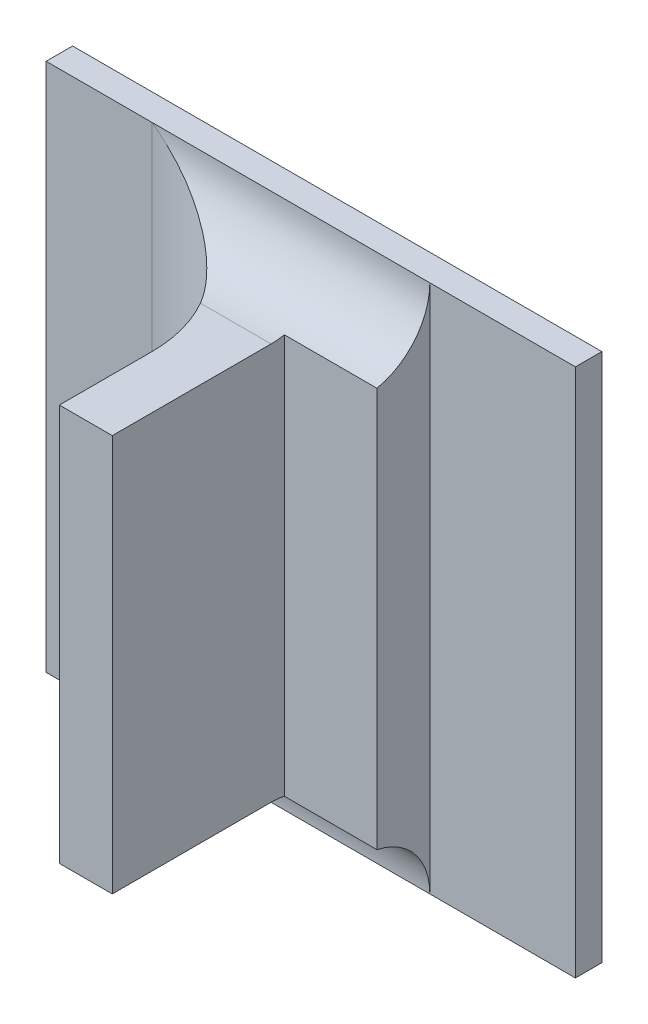
ISO-10303-21;
HEADER;
FILE_DESCRIPTION(('STEP AP214'),'2;1');
FILE_NAME('part.step','',(''),(''),'','','');
FILE_SCHEMA(('AUTOMOTIVE_DESIGN { 1 0 10303 214 1 1 1 1 }'));
ENDSEC;
DATA;
#1=APPLICATION_CONTEXT('core data for automotive mechanical design processes');
#2=APPLICATION_PROTOCOL_DEFINITION('international standard','automotive_design',2000,#1);
#3=PRODUCT_CONTEXT('',#1,'mechanical');
#4=PRODUCT('Part','Part','',(#3));
#5=PRODUCT_RELATED_PRODUCT_CATEGORY('part','',(#4));
#6=PRODUCT_DEFINITION_FORMATION('','',#4);
#7=PRODUCT_DEFINITION_CONTEXT('part definition',#1,'design');
#8=PRODUCT_DEFINITION('design','',#6,#7);
#9=PRODUCT_DEFINITION_SHAPE('','',#8);
#10=(LENGTH_UNIT() NAMED_UNIT(*) SI_UNIT(.MILLI.,.METRE.));
#11=(NAMED_UNIT(*) PLANE_ANGLE_UNIT() SI_UNIT($,.RADIAN.));
#12=(NAMED_UNIT(*) SI_UNIT($,.STERADIAN.) SOLID_ANGLE_UNIT());
#13=UNCERTAINTY_MEASURE_WITH_UNIT(LENGTH_MEASURE(1.E-05),#10,'distance_accuracy_value','');
#14=(GEOMETRIC_REPRESENTATION_CONTEXT(3) GLOBAL_UNCERTAINTY_ASSIGNED_CONTEXT((#13)) GLOBAL_UNIT_ASSIGNED_CONTEXT((#10,
#11,#12)) REPRESENTATION_CONTEXT('',''));
#15=CARTESIAN_POINT('',(0.,0.,0.));
#16=DIRECTION('',(0.,0.,1.));
#17=DIRECTION('',(1.,0.,0.));
#18=AXIS2_PLACEMENT_3D('',#15,#16,#17);
#19=CARTESIAN_POINT('',(-1.06509578137238,-0.311549667580546,0.0888870078740156));
#20=DIRECTION('',(0.,0.,1.));
#21=DIRECTION('',(1.,0.,0.));
#22=AXIS2_PLACEMENT_3D('',#19,#20,#21);
#23=PLANE('',#22);
#24=DIRECTION('',(1.,0.,0.));
#25=VECTOR('',#24,1.);
#26=CARTESIAN_POINT('',(-1.07241135083412,-0.351234706950624,0.0888870078740156));
#27=LINE('',#26,#25);
#28=CARTESIAN_POINT('',(-1.06534774987631,-0.351234706950624,0.0888870078740156));
#29=VERTEX_POINT('',#28);
#30=CARTESIAN_POINT('',(-1.07038711995505,-0.351234706950624,0.0888870078740156));
#31=VERTEX_POINT('',#30);
#32=EDGE_CURVE('E193',#29,#31,#27,.F.);
#33=ORIENTED_EDGE('',*,*,#32,.F.);
#34=DIRECTION('',(0.,1.,0.));
#35=VECTOR('',#34,1.);
#36=CARTESIAN_POINT('',(-1.06534774987631,-0.35326446766354,0.0888870078740156));
#37=LINE('',#36,#35);
#38=CARTESIAN_POINT('',(-1.06534774987631,-0.313439431360073,0.0888870078740156));
#39=VERTEX_POINT('',#38);
#40=EDGE_CURVE('E187',#39,#29,#37,.F.);
#41=ORIENTED_EDGE('',*,*,#40,.F.);
#42=DIRECTION('',(1.,0.,0.));
#43=VECTOR('',#42,1.);
#44=CARTESIAN_POINT('',(-1.07241135083412,-0.313439431360073,0.0888870078740156));
#45=LINE('',#44,#43);
#46=CARTESIAN_POINT('',(-1.07038711995505,-0.313439431360073,0.0888870078740156));
#47=VERTEX_POINT('',#46);
#48=EDGE_CURVE('E180',#39,#47,#45,.F.);
#49=ORIENTED_EDGE('',*,*,#48,.T.);
#50=DIRECTION('',(0.,-1.,0.));
#51=VECTOR('',#50,1.);
#52=CARTESIAN_POINT('',(-1.07038711995505,-0.311549667580546,0.0888870078740156));
#53=LINE('',#52,#51);
#54=EDGE_CURVE('E177',#31,#47,#53,.F.);
#55=ORIENTED_EDGE('',*,*,#54,.F.);
#56=EDGE_LOOP('',(#33,#41,#49,#55));
#57=FACE_BOUND('',#56,.T.);
#58=ADVANCED_FACE('F17',(#57),#23,.T.);
#59=CARTESIAN_POINT('',(-1.07038711995505,-0.311549667580546,0.0796271653543306));
#60=DIRECTION('',(-1.,0.,0.));
#61=DIRECTION('',(0.,-1.,0.));
#62=AXIS2_PLACEMENT_3D('',#59,#60,#61);
#63=PLANE('',#62);
#64=DIRECTION('',(0.,0.,1.));
#65=VECTOR('',#64,1.);
#66=CARTESIAN_POINT('',(-1.07038711995505,-0.313439431360073,0.0730129921259841));
#67=LINE('',#66,#65);
#68=CARTESIAN_POINT('',(-1.07038711995505,-0.313439431360073,0.0800681102362204));
#69=VERTEX_POINT('',#68);
#70=EDGE_CURVE('E184',#47,#69,#67,.F.);
#71=ORIENTED_EDGE('',*,*,#70,.T.);
#72=DIRECTION('',(0.,1.,0.));
#73=VECTOR('',#72,1.);
#74=CARTESIAN_POINT('',(-1.07038711995505,-0.36005360458842,0.0800681102362204));
#75=LINE('',#74,#73);
#76=CARTESIAN_POINT('',(-1.07038711995505,-0.351234706950624,0.0800681102362204));
#77=VERTEX_POINT('',#76);
#78=EDGE_CURVE('E127',#69,#77,#75,.F.);
#79=ORIENTED_EDGE('',*,*,#78,.T.);
#80=DIRECTION('',(0.,0.,1.));
#81=VECTOR('',#80,1.);
#82=CARTESIAN_POINT('',(-1.07038711995505,-0.351234706950624,0.0730129921259841));
#83=LINE('',#82,#81);
#84=EDGE_CURVE('E196',#31,#77,#83,.F.);
#85=ORIENTED_EDGE('',*,*,#84,.F.);
#86=ORIENTED_EDGE('',*,*,#54,.T.);
#87=EDGE_LOOP('',(#71,#79,#85,#86));
#88=FACE_BOUND('',#87,.T.);
#89=ADVANCED_FACE('F242',(#88),#63,.T.);
#90=CARTESIAN_POINT('',(-1.07241135083412,-0.313439431360073,0.0730129921259841));
#91=DIRECTION('',(0.,-1.,0.));
#92=DIRECTION('',(1.,0.,0.));
#93=AXIS2_PLACEMENT_3D('',#90,#91,#92);
#94=PLANE('',#93);
#95=ORIENTED_EDGE('',*,*,#70,.F.);
#96=ORIENTED_EDGE('',*,*,#48,.F.);
#97=DIRECTION('',(0.,0.,1.));
#98=VECTOR('',#97,1.);
#99=CARTESIAN_POINT('',(-1.06534774987631,-0.313439431360073,0.0716901574803148));
#100=LINE('',#99,#98);
#101=CARTESIAN_POINT('',(-1.06534774987631,-0.313439431360073,0.0737688976377952));
#102=VERTEX_POINT('',#101);
#103=EDGE_CURVE('E115',#102,#39,#100,.T.);
#104=ORIENTED_EDGE('',*,*,#103,.F.);
#105=DIRECTION('',(1.,0.,0.));
#106=VECTOR('',#105,1.);
#107=CARTESIAN_POINT('',(-1.08430837979757,-0.313439431360073,0.0737688976377952));
#108=LINE('',#107,#106);
#109=CARTESIAN_POINT('',(-1.07207498888375,-0.313439431360073,0.0737688976377952));
#110=VERTEX_POINT('',#109);
#111=EDGE_CURVE('E109',#102,#110,#108,.F.);
#112=ORIENTED_EDGE('',*,*,#111,.T.);
#113=CARTESIAN_POINT('',(-1.0829855451519,-0.313439431360073,0.0800681102362204));
#114=DIRECTION('',(0.,1.,0.));
#115=DIRECTION('',(-1.,0.,0.));
#116=AXIS2_PLACEMENT_3D('',#113,#114,#115);
#117=CIRCLE('',#116,0.0125984251968504);
#118=EDGE_CURVE('E20',#110,#69,#117,.F.);
#119=ORIENTED_EDGE('',*,*,#118,.T.);
#120=EDGE_LOOP('',(#95,#96,#104,#112,#119));
#121=FACE_BOUND('',#120,.T.);
#122=ADVANCED_FACE('F112',(#121),#94,.F.);
#123=CARTESIAN_POINT('',(-1.07241135083412,-0.351234706950624,0.0730129921259841));
#124=DIRECTION('',(0.,-1.,0.));
#125=DIRECTION('',(1.,0.,0.));
#126=AXIS2_PLACEMENT_3D('',#123,#124,#125);
#127=PLANE('',#126);
#128=CARTESIAN_POINT('',(-1.0829855451519,-0.351234706950624,0.0800681102362204));
#129=DIRECTION('',(0.,1.,0.));
#130=DIRECTION('',(-1.,0.,0.));
#131=AXIS2_PLACEMENT_3D('',#128,#129,#130);
#132=CIRCLE('',#131,0.0125984251968504);
#133=CARTESIAN_POINT('',(-1.07207498888375,-0.351234706950624,0.0737688976377951));
#134=VERTEX_POINT('',#133);
#135=EDGE_CURVE('E121',#77,#134,#132,.T.);
#136=ORIENTED_EDGE('',*,*,#135,.T.);
#137=DIRECTION('',(-1.,0.,0.));
#138=VECTOR('',#137,1.);
#139=CARTESIAN_POINT('',(-1.03007215932513,-0.351234706950625,0.0737688976377952));
#140=LINE('',#139,#138);
#141=CARTESIAN_POINT('',(-1.06534774987631,-0.351234706950624,0.0737688976377952));
#142=VERTEX_POINT('',#141);
#143=EDGE_CURVE('E169',#134,#142,#140,.F.);
#144=ORIENTED_EDGE('',*,*,#143,.T.);
#145=DIRECTION('',(0.,0.,1.));
#146=VECTOR('',#145,1.);
#147=CARTESIAN_POINT('',(-1.06534774987631,-0.351234706950624,0.0716901574803148));
#148=LINE('',#147,#146);
#149=EDGE_CURVE('E190',#29,#142,#148,.F.);
#150=ORIENTED_EDGE('',*,*,#149,.F.);
#151=ORIENTED_EDGE('',*,*,#32,.T.);
#152=ORIENTED_EDGE('',*,*,#84,.T.);
#153=EDGE_LOOP('',(#136,#144,#150,#151,#152));
#154=FACE_BOUND('',#153,.T.);
#155=ADVANCED_FACE('F235',(#154),#127,.T.);
#156=CARTESIAN_POINT('',(-1.06534774987631,-0.35326446766354,0.0716901574803148));
#157=DIRECTION('',(1.,0.,0.));
#158=DIRECTION('',(0.,1.,0.));
#159=AXIS2_PLACEMENT_3D('',#156,#157,#158);
#160=PLANE('',#159);
#161=DIRECTION('',(0.,1.,0.));
#162=VECTOR('',#161,1.);
#163=CARTESIAN_POINT('',(-1.06534774987631,-0.311409670647157,0.0725090551181101));
#164=LINE('',#163,#162);
#165=CARTESIAN_POINT('',(-1.06534774987631,-0.313312161420629,0.0725090551181101));
#166=VERTEX_POINT('',#165);
#167=CARTESIAN_POINT('',(-1.06534774987631,-0.351361976890068,0.0725090551181101));
#168=VERTEX_POINT('',#167);
#169=EDGE_CURVE('E216',#166,#168,#164,.F.);
#170=ORIENTED_EDGE('',*,*,#169,.F.);
#171=CARTESIAN_POINT('',(-1.06534774987631,-0.313312161420629,0.0725090551181101));
#172=CARTESIAN_POINT('',(-1.06534774987631,-0.313439431360073,0.0731325479405746));
#173=CARTESIAN_POINT('',(-1.06534774987631,-0.313439431360073,0.0737688976377952));
#174=B_SPLINE_CURVE_WITH_KNOTS('',2,(#171,#172,#173),.UNSPECIFIED.,.F.,.F.,(3,3),(0.,1.),.UNSPECIFIED.);
#175=EDGE_CURVE('E217',#166,#102,#174,.T.);
#176=ORIENTED_EDGE('',*,*,#175,.T.);
#177=ORIENTED_EDGE('',*,*,#103,.T.);
#178=ORIENTED_EDGE('',*,*,#40,.T.);
#179=ORIENTED_EDGE('',*,*,#149,.T.);
#180=CARTESIAN_POINT('',(-1.06534774987631,-0.351234706950624,0.0737688976377952));
#181=CARTESIAN_POINT('',(-1.06534774987631,-0.351234706950624,0.0731325479405795));
#182=CARTESIAN_POINT('',(-1.06534774987631,-0.351361976890068,0.0725090551181101));
#183=B_SPLINE_CURVE_WITH_KNOTS('',2,(#180,#181,#182),.UNSPECIFIED.,.F.,.F.,(3,3),(0.,1.),.UNSPECIFIED.);
#184=EDGE_CURVE('E221',#142,#168,#183,.T.);
#185=ORIENTED_EDGE('',*,*,#184,.T.);
#186=EDGE_LOOP('',(#170,#176,#177,#178,#179,#185));
#187=FACE_BOUND('',#186,.T.);
#188=ADVANCED_FACE('F224',(#187),#160,.T.);
#189=CARTESIAN_POINT('',(-1.05608790735663,-0.311409670647157,0.0725090551181101));
#190=DIRECTION('',(0.,0.,1.));
#191=DIRECTION('',(1.,0.,0.));
#192=AXIS2_PLACEMENT_3D('',#189,#190,#191);
#193=PLANE('',#192);
#194=DIRECTION('',(0.,1.,0.));
#195=VECTOR('',#194,1.);
#196=CARTESIAN_POINT('',(-1.05652885223852,-0.304620533722278,0.0725090551181101));
#197=LINE('',#196,#195);
#198=CARTESIAN_POINT('',(-1.05652885223852,-0.313312161420629,0.0725090551181101));
#199=VERTEX_POINT('',#198);
#200=CARTESIAN_POINT('',(-1.05652885223852,-0.351361976890069,0.0725090551181102));
#201=VERTEX_POINT('',#200);
#202=EDGE_CURVE('E128',#199,#201,#197,.F.);
#203=ORIENTED_EDGE('',*,*,#202,.F.);
#204=DIRECTION('',(1.,0.,0.));
#205=VECTOR('',#204,1.);
#206=CARTESIAN_POINT('',(-1.08430837979757,-0.313312161420629,0.0725090551181101));
#207=LINE('',#206,#205);
#208=EDGE_CURVE('E139',#199,#166,#207,.F.);
#209=ORIENTED_EDGE('',*,*,#208,.T.);
#210=ORIENTED_EDGE('',*,*,#169,.T.);
#211=DIRECTION('',(-1.,0.,0.));
#212=VECTOR('',#211,1.);
#213=CARTESIAN_POINT('',(-1.03007215932513,-0.351361976890069,0.0725090551181103));
#214=LINE('',#213,#212);
#215=EDGE_CURVE('E174',#168,#201,#214,.F.);
#216=ORIENTED_EDGE('',*,*,#215,.T.);
#217=EDGE_LOOP('',(#203,#209,#210,#216));
#218=FACE_BOUND('',#217,.T.);
#219=ADVANCED_FACE('F234',(#218),#193,.T.);
#220=CARTESIAN_POINT('',(-1.05652885223852,-0.304620533722278,0.067217716535433));
#221=DIRECTION('',(1.,0.,0.));
#222=DIRECTION('',(0.,1.,0.));
#223=AXIS2_PLACEMENT_3D('',#220,#221,#222);
#224=PLANE('',#223);
#225=DIRECTION('',(0.,1.,0.));
#226=VECTOR('',#225,1.);
#227=CARTESIAN_POINT('',(-1.05652885223852,-0.304620533722278,0.06746968503937));
#228=LINE('',#227,#226);
#229=CARTESIAN_POINT('',(-1.05652885223852,-0.35753391954905,0.06746968503937));
#230=VERTEX_POINT('',#229);
#231=CARTESIAN_POINT('',(-1.05652885223852,-0.307140218761648,0.06746968503937));
#232=VERTEX_POINT('',#231);
#233=EDGE_CURVE('E170',#230,#232,#228,.T.);
#234=ORIENTED_EDGE('',*,*,#233,.T.);
#235=CARTESIAN_POINT('',(-1.05652885223852,-0.307140218761648,0.0737688976377952));
#236=DIRECTION('',(1.,0.,0.));
#237=DIRECTION('',(0.,1.,0.));
#238=AXIS2_PLACEMENT_3D('',#235,#236,#237);
#239=CIRCLE('',#238,0.0062992125984252);
#240=EDGE_CURVE('E136',#232,#199,#239,.F.);
#241=ORIENTED_EDGE('',*,*,#240,.T.);
#242=ORIENTED_EDGE('',*,*,#202,.T.);
#243=CARTESIAN_POINT('',(-1.05652885223852,-0.35753391954905,0.0737688976377952));
#244=DIRECTION('',(-1.,0.,0.));
#245=DIRECTION('',(0.,-1.,0.));
#246=AXIS2_PLACEMENT_3D('',#243,#244,#245);
#247=CIRCLE('',#246,0.0062992125984252);
#248=EDGE_CURVE('E171',#201,#230,#247,.T.);
#249=ORIENTED_EDGE('',*,*,#248,.T.);
#250=EDGE_LOOP('',(#234,#241,#242,#249));
#251=FACE_BOUND('',#250,.T.);
#252=ADVANCED_FACE('F318',(#251),#224,.T.);
#253=CARTESIAN_POINT('',(-1.0829855451519,-0.36005360458842,0.0800681102362204));
#254=DIRECTION('',(0.,1.,0.));
#255=DIRECTION('',(-1.,0.,0.));
#256=AXIS2_PLACEMENT_3D('',#253,#254,#255);
#257=CYLINDRICAL_SURFACE('',#256,0.0125984251968504);
#258=ORIENTED_EDGE('',*,*,#78,.F.);
#259=ORIENTED_EDGE('',*,*,#118,.F.);
#260=CARTESIAN_POINT('',(-1.07207498888375,-0.313439431360073,0.073768897637795));
#261=CARTESIAN_POINT('',(-1.07234747338823,-0.313438873707853,0.0732955457546592));
#262=CARTESIAN_POINT('',(-1.07264958551383,-0.313386346377414,0.0728445682080298));
#263=CARTESIAN_POINT('',(-1.07329505328783,-0.313201363699116,0.0720003898002664));
#264=CARTESIAN_POINT('',(-1.07363778576309,-0.313070015578846,0.0716064807283955));
#265=CARTESIAN_POINT('',(-1.07442302288786,-0.312719656172453,0.0708064921171964));
#266=CARTESIAN_POINT('',(-1.07487209401617,-0.312488708936628,0.0704123993317734));
#267=CARTESIAN_POINT('',(-1.07580202027777,-0.311970610304802,0.0697017381084182));
#268=CARTESIAN_POINT('',(-1.07628305354846,-0.311683122697778,0.0693856602556568));
#269=CARTESIAN_POINT('',(-1.07746379099296,-0.310946965938325,0.0687164538298326));
#270=CARTESIAN_POINT('',(-1.07817306810433,-0.310480210038906,0.0684002761150404));
#271=CARTESIAN_POINT('',(-1.07961009581918,-0.309508649017801,0.0679065689436589));
#272=CARTESIAN_POINT('',(-1.08033781457896,-0.309003906866,0.0677288153407497));
#273=CARTESIAN_POINT('',(-1.08151377714844,-0.308179722442743,0.0675478835698786));
#274=CARTESIAN_POINT('',(-1.08195963193271,-0.307865289365079,0.0675035718032503));
#275=CARTESIAN_POINT('',(-1.08259905297728,-0.307413510055304,0.0674741343290926));
#276=CARTESIAN_POINT('',(-1.08279230362694,-0.307276860634179,0.0674696949622004));
#277=CARTESIAN_POINT('',(-1.0829855451519,-0.307140218761648,0.06746968503937));
#278=B_SPLINE_CURVE_WITH_KNOTS('',3,(#260,#261,#262,#263,#264,#265,#266,#267,#268,#269,#270,
#271,#272,#273,#274,#275,#276,#277),.UNSPECIFIED.,.F.,.F.,(4,2,2,2,2,2,2,2,4),(0.,
0.00162828046163526,0.00323420635682056,0.00514617952943915,0.00706988591555801,
0.00977367423346218,0.012473075225337,0.0141132082090728,0.014823218803943),.UNSPECIFIED.);
#279=CARTESIAN_POINT('',(-1.0829855451519,-0.307140218761648,0.06746968503937));
#280=VERTEX_POINT('',#279);
#281=EDGE_CURVE('E120',#110,#280,#278,.T.);
#282=ORIENTED_EDGE('',*,*,#281,.T.);
#283=DIRECTION('',(0.,1.,0.));
#284=VECTOR('',#283,1.);
#285=CARTESIAN_POINT('',(-1.0829855451519,-0.304620533722278,0.06746968503937));
#286=LINE('',#285,#284);
#287=CARTESIAN_POINT('',(-1.0829855451519,-0.35753391954905,0.06746968503937));
#288=VERTEX_POINT('',#287);
#289=EDGE_CURVE('E173',#280,#288,#286,.F.);
#290=ORIENTED_EDGE('',*,*,#289,.T.);
#291=CARTESIAN_POINT('',(-1.07207498888375,-0.351234706950625,0.0737688976377951));
#292=CARTESIAN_POINT('',(-1.07234747338823,-0.351235264602845,0.0732955457546592));
#293=CARTESIAN_POINT('',(-1.07264958551383,-0.351287791933284,0.0728445682080298));
#294=CARTESIAN_POINT('',(-1.07329505328783,-0.351472774611582,0.0720003898002664));
#295=CARTESIAN_POINT('',(-1.07363778576309,-0.351604122731852,0.0716064807283955));
#296=CARTESIAN_POINT('',(-1.07442302288786,-0.351954482138245,0.0708064921171964));
#297=CARTESIAN_POINT('',(-1.07487209401617,-0.35218542937407,0.0704123993317734));
#298=CARTESIAN_POINT('',(-1.07580202027777,-0.352703528005896,0.0697017381084182));
#299=CARTESIAN_POINT('',(-1.07628305354846,-0.35299101561292,0.0693856602556568));
#300=CARTESIAN_POINT('',(-1.07746379099296,-0.353727172372372,0.0687164538298326));
#301=CARTESIAN_POINT('',(-1.07817306810433,-0.354193928271792,0.0684002761150406));
#302=CARTESIAN_POINT('',(-1.07961009581918,-0.355165489292897,0.067906568943659));
#303=CARTESIAN_POINT('',(-1.08033781457896,-0.355670231444698,0.0677288153407497));
#304=CARTESIAN_POINT('',(-1.08151377714844,-0.356494415867954,0.0675478835698786));
#305=CARTESIAN_POINT('',(-1.08195963193271,-0.356808848945619,0.0675035718032502));
#306=CARTESIAN_POINT('',(-1.08259905297728,-0.357260628255394,0.0674741343290926));
#307=CARTESIAN_POINT('',(-1.08279230362694,-0.357397277676519,0.0674696949622004));
#308=CARTESIAN_POINT('',(-1.0829855451519,-0.35753391954905,0.06746968503937));
#309=B_SPLINE_CURVE_WITH_KNOTS('',3,(#291,#292,#293,#294,#295,#296,#297,#298,#299,#300,#301,
#302,#303,#304,#305,#306,#307,#308),.UNSPECIFIED.,.F.,.F.,(4,2,2,2,2,2,2,2,4),(0.,
0.00162828046163526,0.00323420635682057,0.00514617952943914,0.00706988591555801,
0.00977367423346186,0.0124730752253368,0.0141132082090729,0.014823218803943),.UNSPECIFIED.);
#310=EDGE_CURVE('E163',#288,#134,#309,.F.);
#311=ORIENTED_EDGE('',*,*,#310,.T.);
#312=ORIENTED_EDGE('',*,*,#135,.F.);
#313=EDGE_LOOP('',(#258,#259,#282,#290,#311,#312));
#314=FACE_BOUND('',#313,.T.);
#315=ADVANCED_FACE('F124',(#314),#257,.F.);
#316=CARTESIAN_POINT('',(-1.08430837979757,-0.307140218761648,0.0737688976377952));
#317=DIRECTION('',(1.,0.,0.));
#318=DIRECTION('',(0.,1.,0.));
#319=AXIS2_PLACEMENT_3D('',#316,#317,#318);
#320=CYLINDRICAL_SURFACE('',#319,0.0062992125984252);
#321=ORIENTED_EDGE('',*,*,#208,.F.);
#322=ORIENTED_EDGE('',*,*,#240,.F.);
#323=DIRECTION('',(-1.,0.,0.));
#324=VECTOR('',#323,1.);
#325=CARTESIAN_POINT('',(-1.04015089948261,-0.307140218761648,0.06746968503937));
#326=LINE('',#325,#324);
#327=EDGE_CURVE('E134',#280,#232,#326,.F.);
#328=ORIENTED_EDGE('',*,*,#327,.F.);
#329=ORIENTED_EDGE('',*,*,#281,.F.);
#330=ORIENTED_EDGE('',*,*,#111,.F.);
#331=ORIENTED_EDGE('',*,*,#175,.F.);
#332=EDGE_LOOP('',(#321,#322,#328,#329,#330,#331));
#333=FACE_BOUND('',#332,.T.);
#334=ADVANCED_FACE('F131',(#333),#320,.F.);
#335=CARTESIAN_POINT('',(-1.05722176562434,-0.304620533722278,0.06746968503937));
#336=DIRECTION('',(0.,0.,-1.));
#337=DIRECTION('',(-1.,0.,0.));
#338=AXIS2_PLACEMENT_3D('',#335,#336,#337);
#339=PLANE('',#338);
#340=DIRECTION('',(0.,1.,0.));
#341=VECTOR('',#340,1.);
#342=CARTESIAN_POINT('',(-1.04267058452198,-0.36005360458842,0.06746968503937));
#343=LINE('',#342,#341);
#344=CARTESIAN_POINT('',(-1.04267058452198,-0.307140218761648,0.06746968503937));
#345=VERTEX_POINT('',#344);
#346=CARTESIAN_POINT('',(-1.04267058452198,-0.35753391954905,0.06746968503937));
#347=VERTEX_POINT('',#346);
#348=EDGE_CURVE('E281',#345,#347,#343,.F.);
#349=ORIENTED_EDGE('',*,*,#348,.F.);
#350=DIRECTION('',(-1.,0.,0.));
#351=VECTOR('',#350,1.);
#352=CARTESIAN_POINT('',(-1.04015089948261,-0.307140218761648,0.06746968503937));
#353=LINE('',#352,#351);
#354=EDGE_CURVE('E206',#232,#345,#353,.F.);
#355=ORIENTED_EDGE('',*,*,#354,.F.);
#356=ORIENTED_EDGE('',*,*,#233,.F.);
#357=DIRECTION('',(1.,0.,0.));
#358=VECTOR('',#357,1.);
#359=CARTESIAN_POINT('',(-1.09558397034875,-0.35753391954905,0.06746968503937));
#360=LINE('',#359,#358);
#361=EDGE_CURVE('E283',#347,#230,#360,.F.);
#362=ORIENTED_EDGE('',*,*,#361,.F.);
#363=EDGE_LOOP('',(#349,#355,#356,#362));
#364=FACE_BOUND('',#363,.T.);
#365=ADVANCED_FACE('F152',(#364),#339,.F.);
#366=CARTESIAN_POINT('',(-1.03007215932513,-0.35753391954905,0.0737688976377952));
#367=DIRECTION('',(-1.,0.,0.));
#368=DIRECTION('',(0.,-1.,0.));
#369=AXIS2_PLACEMENT_3D('',#366,#367,#368);
#370=CYLINDRICAL_SURFACE('',#369,0.0062992125984252);
#371=ORIENTED_EDGE('',*,*,#215,.F.);
#372=ORIENTED_EDGE('',*,*,#184,.F.);
#373=ORIENTED_EDGE('',*,*,#143,.F.);
#374=ORIENTED_EDGE('',*,*,#310,.F.);
#375=DIRECTION('',(1.,0.,0.));
#376=VECTOR('',#375,1.);
#377=CARTESIAN_POINT('',(-1.09558397034875,-0.35753391954905,0.06746968503937));
#378=LINE('',#377,#376);
#379=EDGE_CURVE('E303',#230,#288,#378,.F.);
#380=ORIENTED_EDGE('',*,*,#379,.F.);
#381=ORIENTED_EDGE('',*,*,#248,.F.);
#382=EDGE_LOOP('',(#371,#372,#373,#374,#380,#381));
#383=FACE_BOUND('',#382,.T.);
#384=ADVANCED_FACE('F155',(#383),#370,.F.);
#385=CARTESIAN_POINT('',(-1.09356822231726,-0.304620533722278,0.06746968503937));
#386=DIRECTION('',(0.,0.,-1.));
#387=DIRECTION('',(-1.,0.,0.));
#388=AXIS2_PLACEMENT_3D('',#385,#386,#387);
#389=PLANE('',#388);
#390=DIRECTION('',(-1.,0.,0.));
#391=VECTOR('',#390,1.);
#392=CARTESIAN_POINT('',(-1.04015089948261,-0.307140218761648,0.06746968503937));
#393=LINE('',#392,#391);
#394=CARTESIAN_POINT('',(-1.09306428530938,-0.307140218761648,0.06746968503937));
#395=VERTEX_POINT('',#394);
#396=EDGE_CURVE('E298',#395,#280,#393,.F.);
#397=ORIENTED_EDGE('',*,*,#396,.F.);
#398=DIRECTION('',(0.,-1.,0.));
#399=VECTOR('',#398,1.);
#400=CARTESIAN_POINT('',(-1.09306428530938,-0.304620533722278,0.06746968503937));
#401=LINE('',#400,#399);
#402=CARTESIAN_POINT('',(-1.09306428530938,-0.35753391954905,0.06746968503937));
#403=VERTEX_POINT('',#402);
#404=EDGE_CURVE('E325',#403,#395,#401,.F.);
#405=ORIENTED_EDGE('',*,*,#404,.F.);
#406=DIRECTION('',(1.,0.,0.));
#407=VECTOR('',#406,1.);
#408=CARTESIAN_POINT('',(-1.09558397034875,-0.35753391954905,0.06746968503937));
#409=LINE('',#408,#407);
#410=EDGE_CURVE('E301',#288,#403,#409,.F.);
#411=ORIENTED_EDGE('',*,*,#410,.F.);
#412=ORIENTED_EDGE('',*,*,#289,.F.);
#413=EDGE_LOOP('',(#397,#405,#411,#412));
#414=FACE_BOUND('',#413,.T.);
#415=ADVANCED_FACE('F160',(#414),#389,.F.);
#416=CARTESIAN_POINT('',(-1.04015089948261,-0.307140218761648,0.0648240157480314));
#417=DIRECTION('',(0.,1.,0.));
#418=DIRECTION('',(-1.,0.,0.));
#419=AXIS2_PLACEMENT_3D('',#416,#417,#418);
#420=PLANE('',#419);
#421=ORIENTED_EDGE('',*,*,#354,.T.);
#422=DIRECTION('',(0.,0.,1.));
#423=VECTOR('',#422,1.);
#424=CARTESIAN_POINT('',(-1.04267058452198,-0.307140218761648,0.0648240157480314));
#425=LINE('',#424,#423);
#426=CARTESIAN_POINT('',(-1.04267058452198,-0.307140218761648,0.0649499999999999));
#427=VERTEX_POINT('',#426);
#428=EDGE_CURVE('E208',#427,#345,#425,.T.);
#429=ORIENTED_EDGE('',*,*,#428,.F.);
#430=DIRECTION('',(-1.,0.,0.));
#431=VECTOR('',#430,1.);
#432=CARTESIAN_POINT('',(-1.09558397034875,-0.307140218761648,0.0649499999999999));
#433=LINE('',#432,#431);
#434=CARTESIAN_POINT('',(-1.09306428530938,-0.307140218761648,0.0649499999999999));
#435=VERTEX_POINT('',#434);
#436=EDGE_CURVE('E332',#435,#427,#433,.F.);
#437=ORIENTED_EDGE('',*,*,#436,.F.);
#438=DIRECTION('',(0.,0.,1.));
#439=VECTOR('',#438,1.);
#440=CARTESIAN_POINT('',(-1.09306428530938,-0.307140218761648,0.0648240157480314));
#441=LINE('',#440,#439);
#442=EDGE_CURVE('E329',#395,#435,#441,.F.);
#443=ORIENTED_EDGE('',*,*,#442,.F.);
#444=ORIENTED_EDGE('',*,*,#396,.T.);
#445=ORIENTED_EDGE('',*,*,#327,.T.);
#446=EDGE_LOOP('',(#421,#429,#437,#443,#444,#445));
#447=FACE_BOUND('',#446,.T.);
#448=ADVANCED_FACE('F267',(#447),#420,.T.);
#449=CARTESIAN_POINT('',(-1.04267058452198,-0.36005360458842,0.0648240157480314));
#450=DIRECTION('',(1.,0.,0.));
#451=DIRECTION('',(0.,1.,0.));
#452=AXIS2_PLACEMENT_3D('',#449,#450,#451);
#453=PLANE('',#452);
#454=ORIENTED_EDGE('',*,*,#348,.T.);
#455=DIRECTION('',(0.,0.,1.));
#456=VECTOR('',#455,1.);
#457=CARTESIAN_POINT('',(-1.04267058452198,-0.35753391954905,0.0648240157480314));
#458=LINE('',#457,#456);
#459=CARTESIAN_POINT('',(-1.04267058452198,-0.35753391954905,0.0649499999999999));
#460=VERTEX_POINT('',#459);
#461=EDGE_CURVE('E285',#460,#347,#458,.T.);
#462=ORIENTED_EDGE('',*,*,#461,.F.);
#463=DIRECTION('',(0.,1.,0.));
#464=VECTOR('',#463,1.);
#465=CARTESIAN_POINT('',(-1.04267058452198,-0.304620533722278,0.0649499999999999));
#466=LINE('',#465,#464);
#467=EDGE_CURVE('E288',#427,#460,#466,.F.);
#468=ORIENTED_EDGE('',*,*,#467,.F.);
#469=ORIENTED_EDGE('',*,*,#428,.T.);
#470=EDGE_LOOP('',(#454,#462,#468,#469));
#471=FACE_BOUND('',#470,.T.);
#472=ADVANCED_FACE('F265',(#471),#453,.T.);
#473=CARTESIAN_POINT('',(-1.09558397034875,-0.35753391954905,0.0648240157480314));
#474=DIRECTION('',(0.,-1.,0.));
#475=DIRECTION('',(1.,0.,0.));
#476=AXIS2_PLACEMENT_3D('',#473,#474,#475);
#477=PLANE('',#476);
#478=ORIENTED_EDGE('',*,*,#410,.T.);
#479=DIRECTION('',(0.,0.,1.));
#480=VECTOR('',#479,1.);
#481=CARTESIAN_POINT('',(-1.09306428530938,-0.35753391954905,0.0648240157480314));
#482=LINE('',#481,#480);
#483=CARTESIAN_POINT('',(-1.09306428530938,-0.35753391954905,0.0649499999999999));
#484=VERTEX_POINT('',#483);
#485=EDGE_CURVE('E35',#484,#403,#482,.T.);
#486=ORIENTED_EDGE('',*,*,#485,.F.);
#487=DIRECTION('',(-1.,0.,0.));
#488=VECTOR('',#487,1.);
#489=CARTESIAN_POINT('',(-1.09558397034875,-0.35753391954905,0.0649499999999999));
#490=LINE('',#489,#488);
#491=EDGE_CURVE('E26',#460,#484,#490,.T.);
#492=ORIENTED_EDGE('',*,*,#491,.F.);
#493=ORIENTED_EDGE('',*,*,#461,.T.);
#494=ORIENTED_EDGE('',*,*,#361,.T.);
#495=ORIENTED_EDGE('',*,*,#379,.T.);
#496=EDGE_LOOP('',(#478,#486,#492,#493,#494,#495));
#497=FACE_BOUND('',#496,.T.);
#498=ADVANCED_FACE('F258',(#497),#477,.T.);
#499=CARTESIAN_POINT('',(-1.09306428530938,-0.304620533722278,0.0648240157480314));
#500=DIRECTION('',(-1.,0.,0.));
#501=DIRECTION('',(0.,-1.,0.));
#502=AXIS2_PLACEMENT_3D('',#499,#500,#501);
#503=PLANE('',#502);
#504=ORIENTED_EDGE('',*,*,#404,.T.);
#505=ORIENTED_EDGE('',*,*,#442,.T.);
#506=DIRECTION('',(0.,1.,0.));
#507=VECTOR('',#506,1.);
#508=CARTESIAN_POINT('',(-1.09306428530938,-0.304620533722278,0.0649499999999999));
#509=LINE('',#508,#507);
#510=EDGE_CURVE('E11',#484,#435,#509,.T.);
#511=ORIENTED_EDGE('',*,*,#510,.F.);
#512=ORIENTED_EDGE('',*,*,#485,.T.);
#513=EDGE_LOOP('',(#504,#505,#511,#512));
#514=FACE_BOUND('',#513,.T.);
#515=ADVANCED_FACE('F252',(#514),#503,.T.);
#516=CARTESIAN_POINT('',(-1.09558397034875,-0.304620533722278,0.0649499999999999));
#517=DIRECTION('',(0.,0.,-1.));
#518=DIRECTION('',(-1.,0.,0.));
#519=AXIS2_PLACEMENT_3D('',#516,#517,#518);
#520=PLANE('',#519);
#521=ORIENTED_EDGE('',*,*,#491,.T.);
#522=ORIENTED_EDGE('',*,*,#510,.T.);
#523=ORIENTED_EDGE('',*,*,#436,.T.);
#524=ORIENTED_EDGE('',*,*,#467,.T.);
#525=EDGE_LOOP('',(#521,#522,#523,#524));
#526=FACE_BOUND('',#525,.T.);
#527=ADVANCED_FACE('F250',(#526),#520,.T.);
#528=CLOSED_SHELL('',(#58,#89,#122,#155,#188,#219,#252,#315,#334,#365,#384,#415,#448,#472,#498,
#515,#527));
#529=MANIFOLD_SOLID_BREP('B1',#528);
#530=ADVANCED_BREP_SHAPE_REPRESENTATION('',(#18,#529),#14);
#531=SHAPE_DEFINITION_REPRESENTATION(#9,#530);
ENDSEC;
END-ISO-10303-21;
